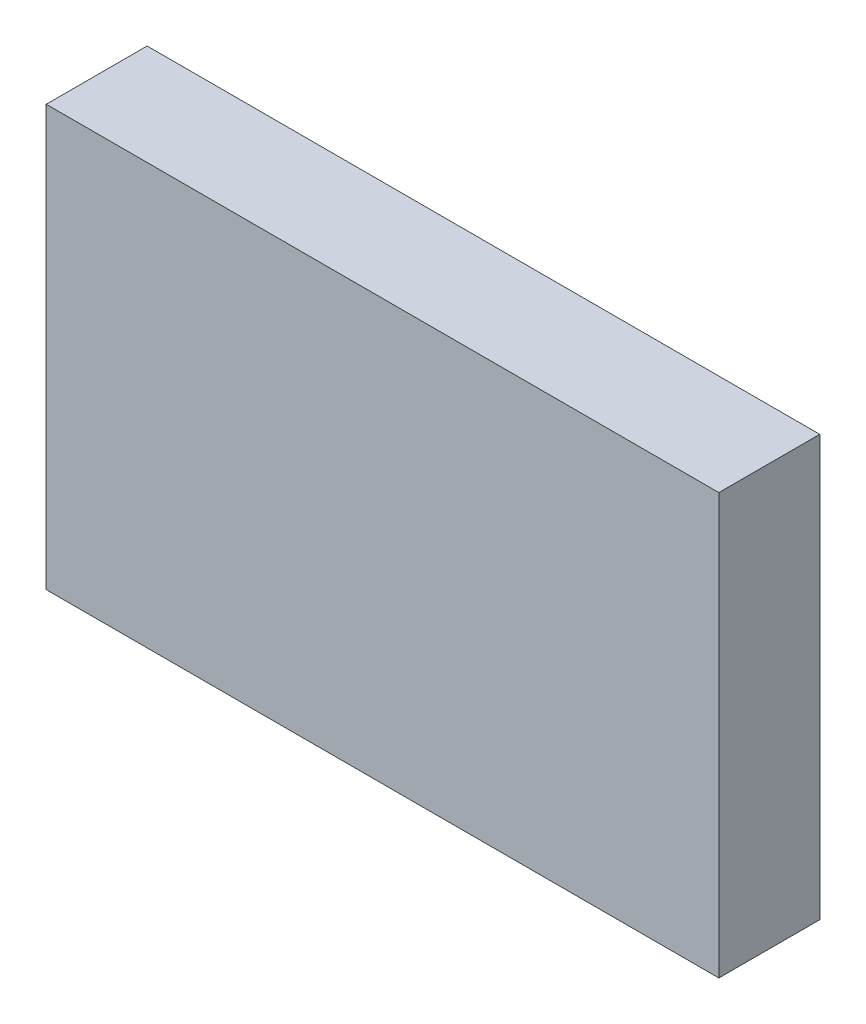
ISO-10303-21;
HEADER;
FILE_DESCRIPTION(('STEP AP214'),'2;1');
FILE_NAME('part.step','',(''),(''),'','','');
FILE_SCHEMA(('AUTOMOTIVE_DESIGN { 1 0 10303 214 1 1 1 1 }'));
ENDSEC;
DATA;
#1=APPLICATION_CONTEXT('core data for automotive mechanical design processes');
#2=APPLICATION_PROTOCOL_DEFINITION('international standard','automotive_design',2000,#1);
#3=PRODUCT_CONTEXT('',#1,'mechanical');
#4=PRODUCT('Part','Part','',(#3));
#5=PRODUCT_RELATED_PRODUCT_CATEGORY('part','',(#4));
#6=PRODUCT_DEFINITION_FORMATION('','',#4);
#7=PRODUCT_DEFINITION_CONTEXT('part definition',#1,'design');
#8=PRODUCT_DEFINITION('design','',#6,#7);
#9=PRODUCT_DEFINITION_SHAPE('','',#8);
#10=(LENGTH_UNIT() NAMED_UNIT(*) SI_UNIT(.MILLI.,.METRE.));
#11=(NAMED_UNIT(*) PLANE_ANGLE_UNIT() SI_UNIT($,.RADIAN.));
#12=(NAMED_UNIT(*) SI_UNIT($,.STERADIAN.) SOLID_ANGLE_UNIT());
#13=UNCERTAINTY_MEASURE_WITH_UNIT(LENGTH_MEASURE(1.E-05),#10,'distance_accuracy_value','');
#14=(GEOMETRIC_REPRESENTATION_CONTEXT(3) GLOBAL_UNCERTAINTY_ASSIGNED_CONTEXT((#13)) GLOBAL_UNIT_ASSIGNED_CONTEXT((#10,
#11,#12)) REPRESENTATION_CONTEXT('',''));
#15=CARTESIAN_POINT('',(0.,0.,0.));
#16=DIRECTION('',(0.,0.,1.));
#17=DIRECTION('',(1.,0.,0.));
#18=AXIS2_PLACEMENT_3D('',#15,#16,#17);
#19=CARTESIAN_POINT('',(-1.00000054,-0.62499748,0.2999994));
#20=DIRECTION('',(0.,0.,1.));
#21=DIRECTION('',(1.,0.,0.));
#22=AXIS2_PLACEMENT_3D('',#19,#20,#21);
#23=PLANE('',#22);
#24=DIRECTION('',(1.,0.,0.));
#25=VECTOR('',#24,1.);
#26=CARTESIAN_POINT('',(-1.00000054,0.62500002,0.2999994));
#27=LINE('',#26,#25);
#28=CARTESIAN_POINT('',(-1.00000054,0.62500002,0.2999994));
#29=VERTEX_POINT('',#28);
#30=CARTESIAN_POINT('',(1.00000054,0.62500002,0.2999994));
#31=VERTEX_POINT('',#30);
#32=EDGE_CURVE('E53',#29,#31,#27,.T.);
#33=ORIENTED_EDGE('',*,*,#32,.F.);
#34=DIRECTION('',(0.,1.,0.));
#35=VECTOR('',#34,1.);
#36=CARTESIAN_POINT('',(-1.00000054,-0.62499748,0.2999994));
#37=LINE('',#36,#35);
#38=CARTESIAN_POINT('',(-1.00000054,-0.62499748,0.2999994));
#39=VERTEX_POINT('',#38);
#40=EDGE_CURVE('E20',#29,#39,#37,.F.);
#41=ORIENTED_EDGE('',*,*,#40,.T.);
#42=DIRECTION('',(1.,0.,0.));
#43=VECTOR('',#42,1.);
#44=CARTESIAN_POINT('',(1.00000054,-0.62499748,0.2999994));
#45=LINE('',#44,#43);
#46=CARTESIAN_POINT('',(1.00000054,-0.62499748,0.2999994));
#47=VERTEX_POINT('',#46);
#48=EDGE_CURVE('E67',#47,#39,#45,.F.);
#49=ORIENTED_EDGE('',*,*,#48,.F.);
#50=DIRECTION('',(0.,1.,0.));
#51=VECTOR('',#50,1.);
#52=CARTESIAN_POINT('',(1.00000054,0.62500002,0.2999994));
#53=LINE('',#52,#51);
#54=EDGE_CURVE('E58',#31,#47,#53,.F.);
#55=ORIENTED_EDGE('',*,*,#54,.F.);
#56=EDGE_LOOP('',(#33,#41,#49,#55));
#57=FACE_BOUND('',#56,.T.);
#58=ADVANCED_FACE('F17',(#57),#23,.T.);
#59=CARTESIAN_POINT('',(1.00000054,-0.62499748,0.));
#60=DIRECTION('',(0.,-1.,0.));
#61=DIRECTION('',(0.,0.,-1.));
#62=AXIS2_PLACEMENT_3D('',#59,#60,#61);
#63=PLANE('',#62);
#64=DIRECTION('',(0.,0.,1.));
#65=VECTOR('',#64,1.);
#66=CARTESIAN_POINT('',(-1.00000054,-0.62499748,0.));
#67=LINE('',#66,#65);
#68=CARTESIAN_POINT('',(-1.00000054,-0.62499748,0.));
#69=VERTEX_POINT('',#68);
#70=EDGE_CURVE('E80',#69,#39,#67,.T.);
#71=ORIENTED_EDGE('',*,*,#70,.F.);
#72=DIRECTION('',(1.,0.,0.));
#73=VECTOR('',#72,1.);
#74=CARTESIAN_POINT('',(-1.00000054,-0.62499748,0.));
#75=LINE('',#74,#73);
#76=CARTESIAN_POINT('',(1.00000054,-0.62499748,0.));
#77=VERTEX_POINT('',#76);
#78=EDGE_CURVE('E75',#69,#77,#75,.T.);
#79=ORIENTED_EDGE('',*,*,#78,.T.);
#80=DIRECTION('',(0.,0.,-1.));
#81=VECTOR('',#80,1.);
#82=CARTESIAN_POINT('',(1.00000054,-0.62499748,0.));
#83=LINE('',#82,#81);
#84=EDGE_CURVE('E63',#47,#77,#83,.T.);
#85=ORIENTED_EDGE('',*,*,#84,.F.);
#86=ORIENTED_EDGE('',*,*,#48,.T.);
#87=EDGE_LOOP('',(#71,#79,#85,#86));
#88=FACE_BOUND('',#87,.T.);
#89=ADVANCED_FACE('F74',(#88),#63,.T.);
#90=CARTESIAN_POINT('',(1.00000054,0.62500002,0.));
#91=DIRECTION('',(1.,0.,0.));
#92=DIRECTION('',(0.,0.,-1.));
#93=AXIS2_PLACEMENT_3D('',#90,#91,#92);
#94=PLANE('',#93);
#95=ORIENTED_EDGE('',*,*,#84,.T.);
#96=DIRECTION('',(0.,1.,0.));
#97=VECTOR('',#96,1.);
#98=CARTESIAN_POINT('',(1.00000054,-0.62499748,0.));
#99=LINE('',#98,#97);
#100=CARTESIAN_POINT('',(1.00000054,0.62500002,0.));
#101=VERTEX_POINT('',#100);
#102=EDGE_CURVE('E84',#77,#101,#99,.T.);
#103=ORIENTED_EDGE('',*,*,#102,.T.);
#104=DIRECTION('',(0.,0.,1.));
#105=VECTOR('',#104,1.);
#106=CARTESIAN_POINT('',(1.00000054,0.62500002,0.));
#107=LINE('',#106,#105);
#108=EDGE_CURVE('E65',#31,#101,#107,.F.);
#109=ORIENTED_EDGE('',*,*,#108,.F.);
#110=ORIENTED_EDGE('',*,*,#54,.T.);
#111=EDGE_LOOP('',(#95,#103,#109,#110));
#112=FACE_BOUND('',#111,.T.);
#113=ADVANCED_FACE('F60',(#112),#94,.T.);
#114=CARTESIAN_POINT('',(-1.00000054,0.62500002,0.));
#115=DIRECTION('',(0.,1.,0.));
#116=DIRECTION('',(0.,0.,1.));
#117=AXIS2_PLACEMENT_3D('',#114,#115,#116);
#118=PLANE('',#117);
#119=ORIENTED_EDGE('',*,*,#108,.T.);
#120=DIRECTION('',(1.,0.,0.));
#121=VECTOR('',#120,1.);
#122=CARTESIAN_POINT('',(-1.00000054,0.62500002,0.));
#123=LINE('',#122,#121);
#124=CARTESIAN_POINT('',(-1.00000054,0.62500002,0.));
#125=VERTEX_POINT('',#124);
#126=EDGE_CURVE('E26',#101,#125,#123,.F.);
#127=ORIENTED_EDGE('',*,*,#126,.T.);
#128=DIRECTION('',(0.,0.,1.));
#129=VECTOR('',#128,1.);
#130=CARTESIAN_POINT('',(-1.00000054,0.62500002,0.));
#131=LINE('',#130,#129);
#132=EDGE_CURVE('E34',#29,#125,#131,.F.);
#133=ORIENTED_EDGE('',*,*,#132,.F.);
#134=ORIENTED_EDGE('',*,*,#32,.T.);
#135=EDGE_LOOP('',(#119,#127,#133,#134));
#136=FACE_BOUND('',#135,.T.);
#137=ADVANCED_FACE('F88',(#136),#118,.T.);
#138=CARTESIAN_POINT('',(-1.00000054,-0.62499748,0.));
#139=DIRECTION('',(-1.,0.,0.));
#140=DIRECTION('',(0.,0.,1.));
#141=AXIS2_PLACEMENT_3D('',#138,#139,#140);
#142=PLANE('',#141);
#143=ORIENTED_EDGE('',*,*,#132,.T.);
#144=DIRECTION('',(0.,1.,0.));
#145=VECTOR('',#144,1.);
#146=CARTESIAN_POINT('',(-1.00000054,-0.62499748,0.));
#147=LINE('',#146,#145);
#148=EDGE_CURVE('E11',#125,#69,#147,.F.);
#149=ORIENTED_EDGE('',*,*,#148,.T.);
#150=ORIENTED_EDGE('',*,*,#70,.T.);
#151=ORIENTED_EDGE('',*,*,#40,.F.);
#152=EDGE_LOOP('',(#143,#149,#150,#151));
#153=FACE_BOUND('',#152,.T.);
#154=ADVANCED_FACE('F91',(#153),#142,.T.);
#155=CARTESIAN_POINT('',(-1.00000054,-0.62499748,0.));
#156=DIRECTION('',(0.,0.,1.));
#157=DIRECTION('',(1.,0.,0.));
#158=AXIS2_PLACEMENT_3D('',#155,#156,#157);
#159=PLANE('',#158);
#160=ORIENTED_EDGE('',*,*,#126,.F.);
#161=ORIENTED_EDGE('',*,*,#102,.F.);
#162=ORIENTED_EDGE('',*,*,#78,.F.);
#163=ORIENTED_EDGE('',*,*,#148,.F.);
#164=EDGE_LOOP('',(#160,#161,#162,#163));
#165=FACE_BOUND('',#164,.T.);
#166=ADVANCED_FACE('F90',(#165),#159,.F.);
#167=CLOSED_SHELL('',(#58,#89,#113,#137,#154,#166));
#168=MANIFOLD_SOLID_BREP('B1',#167);
#169=ADVANCED_BREP_SHAPE_REPRESENTATION('',(#18,#168),#14);
#170=SHAPE_DEFINITION_REPRESENTATION(#9,#169);
ENDSEC;
END-ISO-10303-21;
